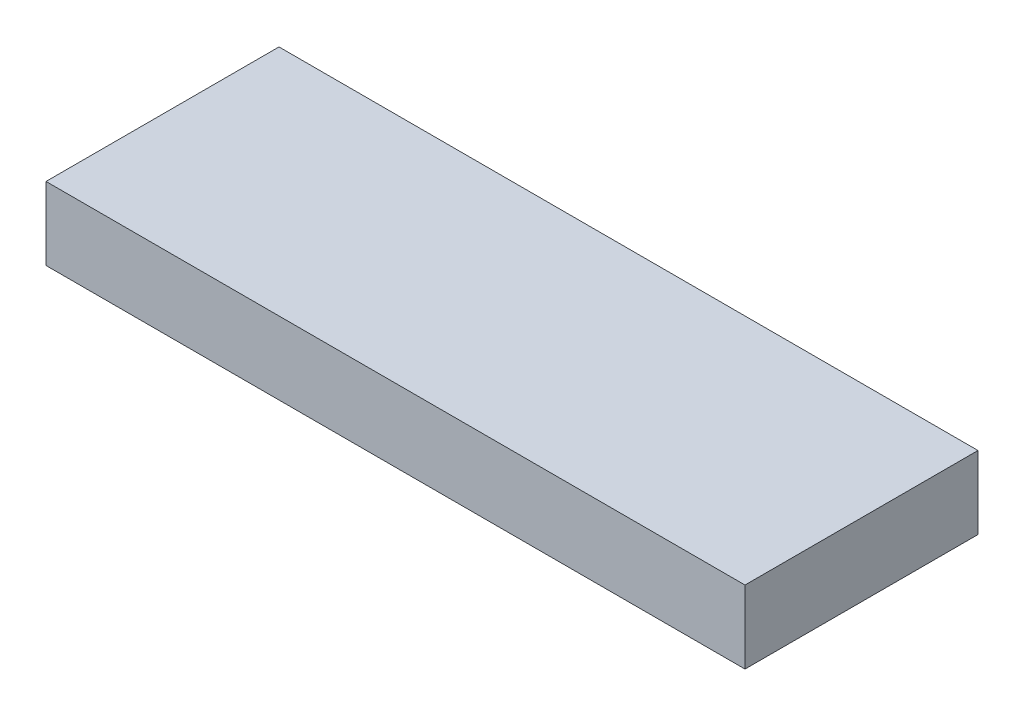
ISO-10303-21;
HEADER;
FILE_DESCRIPTION(('STEP AP214'),'2;1');
FILE_NAME('part.step','',(''),(''),'','','');
FILE_SCHEMA(('AUTOMOTIVE_DESIGN { 1 0 10303 214 1 1 1 1 }'));
ENDSEC;
DATA;
#1=APPLICATION_CONTEXT('core data for automotive mechanical design processes');
#2=APPLICATION_PROTOCOL_DEFINITION('international standard','automotive_design',2000,#1);
#3=PRODUCT_CONTEXT('',#1,'mechanical');
#4=PRODUCT('Part','Part','',(#3));
#5=PRODUCT_RELATED_PRODUCT_CATEGORY('part','',(#4));
#6=PRODUCT_DEFINITION_FORMATION('','',#4);
#7=PRODUCT_DEFINITION_CONTEXT('part definition',#1,'design');
#8=PRODUCT_DEFINITION('design','',#6,#7);
#9=PRODUCT_DEFINITION_SHAPE('','',#8);
#10=(LENGTH_UNIT() NAMED_UNIT(*) SI_UNIT(.MILLI.,.METRE.));
#11=(NAMED_UNIT(*) PLANE_ANGLE_UNIT() SI_UNIT($,.RADIAN.));
#12=(NAMED_UNIT(*) SI_UNIT($,.STERADIAN.) SOLID_ANGLE_UNIT());
#13=UNCERTAINTY_MEASURE_WITH_UNIT(LENGTH_MEASURE(1.E-05),#10,'distance_accuracy_value','');
#14=(GEOMETRIC_REPRESENTATION_CONTEXT(3) GLOBAL_UNCERTAINTY_ASSIGNED_CONTEXT((#13)) GLOBAL_UNIT_ASSIGNED_CONTEXT((#10,
#11,#12)) REPRESENTATION_CONTEXT('',''));
#15=CARTESIAN_POINT('',(0.,0.,0.));
#16=DIRECTION('',(0.,0.,1.));
#17=DIRECTION('',(1.,0.,0.));
#18=AXIS2_PLACEMENT_3D('',#15,#16,#17);
#19=CARTESIAN_POINT('',(-304.8,31.75,-101.6));
#20=DIRECTION('',(1.,0.,0.));
#21=DIRECTION('',(0.,0.,-1.));
#22=AXIS2_PLACEMENT_3D('',#19,#20,#21);
#23=PLANE('',#22);
#24=DIRECTION('',(0.,0.,1.));
#25=VECTOR('',#24,1.);
#26=CARTESIAN_POINT('',(-304.8,-31.75,-101.6));
#27=LINE('',#26,#25);
#28=CARTESIAN_POINT('',(-304.8,-31.75,-101.6));
#29=VERTEX_POINT('',#28);
#30=CARTESIAN_POINT('',(-304.8,-31.75,101.6));
#31=VERTEX_POINT('',#30);
#32=EDGE_CURVE('E96',#29,#31,#27,.T.);
#33=ORIENTED_EDGE('',*,*,#32,.T.);
#34=DIRECTION('',(0.,-1.,0.));
#35=VECTOR('',#34,1.);
#36=CARTESIAN_POINT('',(-304.8,31.75,101.6));
#37=LINE('',#36,#35);
#38=CARTESIAN_POINT('',(-304.8,31.75,101.6));
#39=VERTEX_POINT('',#38);
#40=EDGE_CURVE('E11',#39,#31,#37,.T.);
#41=ORIENTED_EDGE('',*,*,#40,.F.);
#42=DIRECTION('',(0.,0.,1.));
#43=VECTOR('',#42,1.);
#44=CARTESIAN_POINT('',(-304.8,31.75,-101.6));
#45=LINE('',#44,#43);
#46=CARTESIAN_POINT('',(-304.8,31.75,-101.6));
#47=VERTEX_POINT('',#46);
#48=EDGE_CURVE('E84',#47,#39,#45,.T.);
#49=ORIENTED_EDGE('',*,*,#48,.F.);
#50=DIRECTION('',(0.,-1.,0.));
#51=VECTOR('',#50,1.);
#52=CARTESIAN_POINT('',(-304.8,31.75,-101.6));
#53=LINE('',#52,#51);
#54=EDGE_CURVE('E92',#47,#29,#53,.T.);
#55=ORIENTED_EDGE('',*,*,#54,.T.);
#56=EDGE_LOOP('',(#33,#41,#49,#55));
#57=FACE_BOUND('',#56,.T.);
#58=ADVANCED_FACE('F33',(#57),#23,.F.);
#59=CARTESIAN_POINT('',(-304.8,31.75,101.6));
#60=DIRECTION('',(0.,0.,-1.));
#61=DIRECTION('',(-1.,0.,0.));
#62=AXIS2_PLACEMENT_3D('',#59,#60,#61);
#63=PLANE('',#62);
#64=DIRECTION('',(1.,0.,0.));
#65=VECTOR('',#64,1.);
#66=CARTESIAN_POINT('',(-304.8,-31.75,101.6));
#67=LINE('',#66,#65);
#68=CARTESIAN_POINT('',(304.8,-31.75,101.6));
#69=VERTEX_POINT('',#68);
#70=EDGE_CURVE('E88',#31,#69,#67,.T.);
#71=ORIENTED_EDGE('',*,*,#70,.T.);
#72=DIRECTION('',(0.,-1.,0.));
#73=VECTOR('',#72,1.);
#74=CARTESIAN_POINT('',(304.8,31.75,101.6));
#75=LINE('',#74,#73);
#76=CARTESIAN_POINT('',(304.8,31.75,101.6));
#77=VERTEX_POINT('',#76);
#78=EDGE_CURVE('E41',#77,#69,#75,.T.);
#79=ORIENTED_EDGE('',*,*,#78,.F.);
#80=DIRECTION('',(1.,0.,0.));
#81=VECTOR('',#80,1.);
#82=CARTESIAN_POINT('',(-304.8,31.75,101.6));
#83=LINE('',#82,#81);
#84=EDGE_CURVE('E79',#39,#77,#83,.T.);
#85=ORIENTED_EDGE('',*,*,#84,.F.);
#86=ORIENTED_EDGE('',*,*,#40,.T.);
#87=EDGE_LOOP('',(#71,#79,#85,#86));
#88=FACE_BOUND('',#87,.T.);
#89=ADVANCED_FACE('F87',(#88),#63,.F.);
#90=CARTESIAN_POINT('',(304.8,31.75,-101.6));
#91=DIRECTION('',(-1.,0.,0.));
#92=DIRECTION('',(0.,0.,1.));
#93=AXIS2_PLACEMENT_3D('',#90,#91,#92);
#94=PLANE('',#93);
#95=DIRECTION('',(0.,0.,-1.));
#96=VECTOR('',#95,1.);
#97=CARTESIAN_POINT('',(304.8,-31.75,-101.6));
#98=LINE('',#97,#96);
#99=CARTESIAN_POINT('',(304.8,-31.75,-101.6));
#100=VERTEX_POINT('',#99);
#101=EDGE_CURVE('E66',#69,#100,#98,.T.);
#102=ORIENTED_EDGE('',*,*,#101,.T.);
#103=DIRECTION('',(0.,-1.,0.));
#104=VECTOR('',#103,1.);
#105=CARTESIAN_POINT('',(304.8,31.75,-101.6));
#106=LINE('',#105,#104);
#107=CARTESIAN_POINT('',(304.8,31.75,-101.6));
#108=VERTEX_POINT('',#107);
#109=EDGE_CURVE('E89',#108,#100,#106,.T.);
#110=ORIENTED_EDGE('',*,*,#109,.F.);
#111=DIRECTION('',(0.,0.,-1.));
#112=VECTOR('',#111,1.);
#113=CARTESIAN_POINT('',(304.8,31.75,-101.6));
#114=LINE('',#113,#112);
#115=EDGE_CURVE('E82',#77,#108,#114,.T.);
#116=ORIENTED_EDGE('',*,*,#115,.F.);
#117=ORIENTED_EDGE('',*,*,#78,.T.);
#118=EDGE_LOOP('',(#102,#110,#116,#117));
#119=FACE_BOUND('',#118,.T.);
#120=ADVANCED_FACE('F90',(#119),#94,.F.);
#121=CARTESIAN_POINT('',(-304.8,31.75,-101.6));
#122=DIRECTION('',(0.,0.,1.));
#123=DIRECTION('',(1.,0.,0.));
#124=AXIS2_PLACEMENT_3D('',#121,#122,#123);
#125=PLANE('',#124);
#126=DIRECTION('',(-1.,0.,0.));
#127=VECTOR('',#126,1.);
#128=CARTESIAN_POINT('',(-304.8,-31.75,-101.6));
#129=LINE('',#128,#127);
#130=EDGE_CURVE('E72',#100,#29,#129,.T.);
#131=ORIENTED_EDGE('',*,*,#130,.T.);
#132=ORIENTED_EDGE('',*,*,#54,.F.);
#133=DIRECTION('',(-1.,0.,0.));
#134=VECTOR('',#133,1.);
#135=CARTESIAN_POINT('',(-304.8,31.75,-101.6));
#136=LINE('',#135,#134);
#137=EDGE_CURVE('E49',#108,#47,#136,.T.);
#138=ORIENTED_EDGE('',*,*,#137,.F.);
#139=ORIENTED_EDGE('',*,*,#109,.T.);
#140=EDGE_LOOP('',(#131,#132,#138,#139));
#141=FACE_BOUND('',#140,.T.);
#142=ADVANCED_FACE('F103',(#141),#125,.F.);
#143=CARTESIAN_POINT('',(0.,31.75,0.));
#144=DIRECTION('',(0.,1.,0.));
#145=DIRECTION('',(0.,0.,1.));
#146=AXIS2_PLACEMENT_3D('',#143,#144,#145);
#147=PLANE('',#146);
#148=ORIENTED_EDGE('',*,*,#48,.T.);
#149=ORIENTED_EDGE('',*,*,#84,.T.);
#150=ORIENTED_EDGE('',*,*,#115,.T.);
#151=ORIENTED_EDGE('',*,*,#137,.T.);
#152=EDGE_LOOP('',(#148,#149,#150,#151));
#153=FACE_BOUND('',#152,.T.);
#154=ADVANCED_FACE('F80',(#153),#147,.T.);
#155=CARTESIAN_POINT('',(0.,-31.75,0.));
#156=DIRECTION('',(0.,1.,0.));
#157=DIRECTION('',(0.,0.,1.));
#158=AXIS2_PLACEMENT_3D('',#155,#156,#157);
#159=PLANE('',#158);
#160=ORIENTED_EDGE('',*,*,#32,.F.);
#161=ORIENTED_EDGE('',*,*,#130,.F.);
#162=ORIENTED_EDGE('',*,*,#101,.F.);
#163=ORIENTED_EDGE('',*,*,#70,.F.);
#164=EDGE_LOOP('',(#160,#161,#162,#163));
#165=FACE_BOUND('',#164,.T.);
#166=ADVANCED_FACE('F106',(#165),#159,.F.);
#167=CLOSED_SHELL('',(#58,#89,#120,#142,#154,#166));
#168=MANIFOLD_SOLID_BREP('B2',#167);
#169=ADVANCED_BREP_SHAPE_REPRESENTATION('',(#18,#168),#14);
#170=SHAPE_DEFINITION_REPRESENTATION(#9,#169);
ENDSEC;
END-ISO-10303-21;
